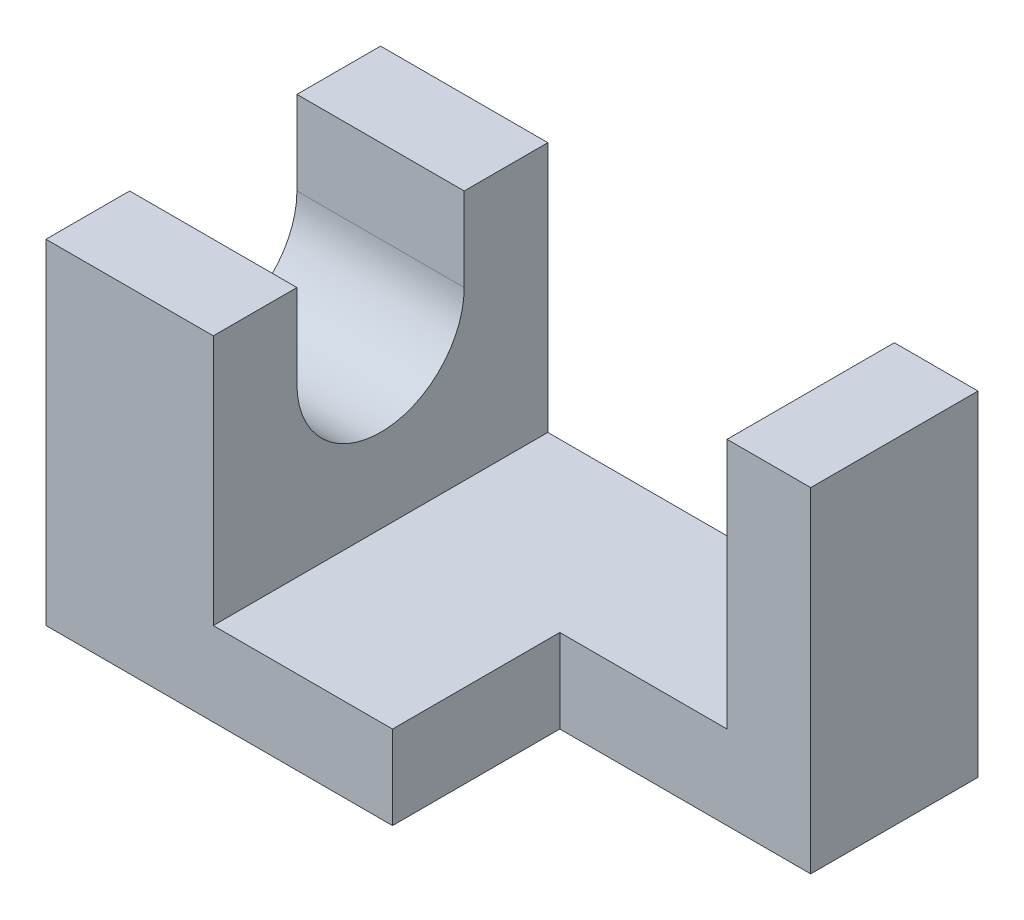
ISO-10303-21;
HEADER;
FILE_DESCRIPTION(('STEP AP214'),'2;1');
FILE_NAME('part.step','',(''),(''),'','','');
FILE_SCHEMA(('AUTOMOTIVE_DESIGN { 1 0 10303 214 1 1 1 1 }'));
ENDSEC;
DATA;
#1=APPLICATION_CONTEXT('core data for automotive mechanical design processes');
#2=APPLICATION_PROTOCOL_DEFINITION('international standard','automotive_design',2000,#1);
#3=PRODUCT_CONTEXT('',#1,'mechanical');
#4=PRODUCT('Part','Part','',(#3));
#5=PRODUCT_RELATED_PRODUCT_CATEGORY('part','',(#4));
#6=PRODUCT_DEFINITION_FORMATION('','',#4);
#7=PRODUCT_DEFINITION_CONTEXT('part definition',#1,'design');
#8=PRODUCT_DEFINITION('design','',#6,#7);
#9=PRODUCT_DEFINITION_SHAPE('','',#8);
#10=(LENGTH_UNIT() NAMED_UNIT(*) SI_UNIT(.MILLI.,.METRE.));
#11=(NAMED_UNIT(*) PLANE_ANGLE_UNIT() SI_UNIT($,.RADIAN.));
#12=(NAMED_UNIT(*) SI_UNIT($,.STERADIAN.) SOLID_ANGLE_UNIT());
#13=UNCERTAINTY_MEASURE_WITH_UNIT(LENGTH_MEASURE(1.E-05),#10,'distance_accuracy_value','');
#14=(GEOMETRIC_REPRESENTATION_CONTEXT(3) GLOBAL_UNCERTAINTY_ASSIGNED_CONTEXT((#13)) GLOBAL_UNIT_ASSIGNED_CONTEXT((#10,
#11,#12)) REPRESENTATION_CONTEXT('',''));
#15=CARTESIAN_POINT('',(0.,0.,0.));
#16=DIRECTION('',(0.,0.,1.));
#17=DIRECTION('',(1.,0.,0.));
#18=AXIS2_PLACEMENT_3D('',#15,#16,#17);
#19=CARTESIAN_POINT('',(0.,28.,14.));
#20=DIRECTION('',(0.,-1.,0.));
#21=DIRECTION('',(0.,0.,-1.));
#22=AXIS2_PLACEMENT_3D('',#19,#20,#21);
#23=PLANE('',#22);
#24=DIRECTION('',(-1.,0.,0.));
#25=VECTOR('',#24,1.);
#26=CARTESIAN_POINT('',(50.001,28.,7.));
#27=LINE('',#26,#25);
#28=CARTESIAN_POINT('',(14.,28.,7.));
#29=VERTEX_POINT('',#28);
#30=CARTESIAN_POINT('',(0.,28.,7.));
#31=VERTEX_POINT('',#30);
#32=EDGE_CURVE('E151',#29,#31,#27,.T.);
#33=ORIENTED_EDGE('',*,*,#32,.T.);
#34=DIRECTION('',(0.,0.,-1.));
#35=VECTOR('',#34,1.);
#36=CARTESIAN_POINT('',(0.,28.,14.));
#37=LINE('',#36,#35);
#38=CARTESIAN_POINT('',(0.,28.,14.));
#39=VERTEX_POINT('',#38);
#40=EDGE_CURVE('E160',#39,#31,#37,.T.);
#41=ORIENTED_EDGE('',*,*,#40,.F.);
#42=DIRECTION('',(-1.,0.,0.));
#43=VECTOR('',#42,1.);
#44=CARTESIAN_POINT('',(0.,28.,14.));
#45=LINE('',#44,#43);
#46=CARTESIAN_POINT('',(14.,28.,14.));
#47=VERTEX_POINT('',#46);
#48=EDGE_CURVE('E192',#47,#39,#45,.T.);
#49=ORIENTED_EDGE('',*,*,#48,.F.);
#50=DIRECTION('',(0.,0.,-1.));
#51=VECTOR('',#50,1.);
#52=CARTESIAN_POINT('',(14.,28.,14.));
#53=LINE('',#52,#51);
#54=EDGE_CURVE('E159',#47,#29,#53,.T.);
#55=ORIENTED_EDGE('',*,*,#54,.T.);
#56=EDGE_LOOP('',(#33,#41,#49,#55));
#57=FACE_BOUND('',#56,.T.);
#58=ADVANCED_FACE('F33',(#57),#23,.F.);
#59=DIRECTION('',(-1.,0.,0.));
#60=VECTOR('',#59,1.);
#61=CARTESIAN_POINT('',(50.001,28.,-7.));
#62=LINE('',#61,#60);
#63=CARTESIAN_POINT('',(14.,28.,-7.));
#64=VERTEX_POINT('',#63);
#65=CARTESIAN_POINT('',(0.,28.,-7.));
#66=VERTEX_POINT('',#65);
#67=EDGE_CURVE('E136',#64,#66,#62,.T.);
#68=ORIENTED_EDGE('',*,*,#67,.F.);
#69=CARTESIAN_POINT('',(14.,28.,-14.));
#70=VERTEX_POINT('',#69);
#71=EDGE_CURVE('E148',#64,#70,#53,.T.);
#72=ORIENTED_EDGE('',*,*,#71,.T.);
#73=DIRECTION('',(-1.,0.,0.));
#74=VECTOR('',#73,1.);
#75=CARTESIAN_POINT('',(0.,28.,-14.));
#76=LINE('',#75,#74);
#77=CARTESIAN_POINT('',(0.,28.,-14.));
#78=VERTEX_POINT('',#77);
#79=EDGE_CURVE('E218',#70,#78,#76,.T.);
#80=ORIENTED_EDGE('',*,*,#79,.T.);
#81=EDGE_CURVE('E150',#66,#78,#37,.T.);
#82=ORIENTED_EDGE('',*,*,#81,.F.);
#83=EDGE_LOOP('',(#68,#72,#80,#82));
#84=FACE_BOUND('',#83,.T.);
#85=ADVANCED_FACE('F146',(#84),#23,.F.);
#86=CARTESIAN_POINT('',(0.,0.,14.));
#87=DIRECTION('',(0.,1.,0.));
#88=DIRECTION('',(0.,0.,1.));
#89=AXIS2_PLACEMENT_3D('',#86,#87,#88);
#90=PLANE('',#89);
#91=DIRECTION('',(-1.,0.,0.));
#92=VECTOR('',#91,1.);
#93=CARTESIAN_POINT('',(50.,0.,0.));
#94=LINE('',#93,#92);
#95=CARTESIAN_POINT('',(50.,0.,0.));
#96=VERTEX_POINT('',#95);
#97=CARTESIAN_POINT('',(29.,0.,0.));
#98=VERTEX_POINT('',#97);
#99=EDGE_CURVE('E235',#96,#98,#94,.T.);
#100=ORIENTED_EDGE('',*,*,#99,.T.);
#101=DIRECTION('',(0.,0.,1.));
#102=VECTOR('',#101,1.);
#103=CARTESIAN_POINT('',(29.,0.,0.));
#104=LINE('',#103,#102);
#105=CARTESIAN_POINT('',(29.,0.,14.));
#106=VERTEX_POINT('',#105);
#107=EDGE_CURVE('E263',#98,#106,#104,.T.);
#108=ORIENTED_EDGE('',*,*,#107,.T.);
#109=DIRECTION('',(1.,0.,0.));
#110=VECTOR('',#109,1.);
#111=CARTESIAN_POINT('',(0.,0.,14.));
#112=LINE('',#111,#110);
#113=CARTESIAN_POINT('',(0.,0.,14.));
#114=VERTEX_POINT('',#113);
#115=EDGE_CURVE('E183',#114,#106,#112,.T.);
#116=ORIENTED_EDGE('',*,*,#115,.F.);
#117=DIRECTION('',(0.,0.,-1.));
#118=VECTOR('',#117,1.);
#119=CARTESIAN_POINT('',(0.,0.,14.));
#120=LINE('',#119,#118);
#121=CARTESIAN_POINT('',(0.,0.,-14.));
#122=VERTEX_POINT('',#121);
#123=EDGE_CURVE('E201',#114,#122,#120,.T.);
#124=ORIENTED_EDGE('',*,*,#123,.T.);
#125=DIRECTION('',(1.,0.,0.));
#126=VECTOR('',#125,1.);
#127=CARTESIAN_POINT('',(0.,0.,-14.));
#128=LINE('',#127,#126);
#129=CARTESIAN_POINT('',(50.,0.,-14.));
#130=VERTEX_POINT('',#129);
#131=EDGE_CURVE('E202',#122,#130,#128,.T.);
#132=ORIENTED_EDGE('',*,*,#131,.T.);
#133=DIRECTION('',(0.,0.,-1.));
#134=VECTOR('',#133,1.);
#135=CARTESIAN_POINT('',(50.,0.,14.));
#136=LINE('',#135,#134);
#137=EDGE_CURVE('E175',#96,#130,#136,.T.);
#138=ORIENTED_EDGE('',*,*,#137,.F.);
#139=EDGE_LOOP('',(#100,#108,#116,#124,#132,#138));
#140=FACE_BOUND('',#139,.T.);
#141=ADVANCED_FACE('F35',(#140),#90,.F.);
#142=CARTESIAN_POINT('',(50.,0.,14.));
#143=DIRECTION('',(-1.,0.,0.));
#144=DIRECTION('',(0.,0.,1.));
#145=AXIS2_PLACEMENT_3D('',#142,#143,#144);
#146=PLANE('',#145);
#147=DIRECTION('',(0.,-1.,0.));
#148=VECTOR('',#147,1.);
#149=CARTESIAN_POINT('',(50.,28.,0.));
#150=LINE('',#149,#148);
#151=CARTESIAN_POINT('',(50.,28.,0.));
#152=VERTEX_POINT('',#151);
#153=EDGE_CURVE('E240',#152,#96,#150,.T.);
#154=ORIENTED_EDGE('',*,*,#153,.T.);
#155=ORIENTED_EDGE('',*,*,#137,.T.);
#156=DIRECTION('',(0.,1.,0.));
#157=VECTOR('',#156,1.);
#158=CARTESIAN_POINT('',(50.,0.,-14.));
#159=LINE('',#158,#157);
#160=CARTESIAN_POINT('',(50.,28.,-14.));
#161=VERTEX_POINT('',#160);
#162=EDGE_CURVE('E205',#130,#161,#159,.T.);
#163=ORIENTED_EDGE('',*,*,#162,.T.);
#164=DIRECTION('',(0.,0.,-1.));
#165=VECTOR('',#164,1.);
#166=CARTESIAN_POINT('',(50.,28.,14.));
#167=LINE('',#166,#165);
#168=EDGE_CURVE('E173',#152,#161,#167,.T.);
#169=ORIENTED_EDGE('',*,*,#168,.F.);
#170=EDGE_LOOP('',(#154,#155,#163,#169));
#171=FACE_BOUND('',#170,.T.);
#172=ADVANCED_FACE('F238',(#171),#146,.F.);
#173=CARTESIAN_POINT('',(50.,28.,14.));
#174=DIRECTION('',(0.,-1.,0.));
#175=DIRECTION('',(0.,0.,-1.));
#176=AXIS2_PLACEMENT_3D('',#173,#174,#175);
#177=PLANE('',#176);
#178=DIRECTION('',(-1.,0.,0.));
#179=VECTOR('',#178,1.);
#180=CARTESIAN_POINT('',(50.,28.,0.));
#181=LINE('',#180,#179);
#182=CARTESIAN_POINT('',(43.,28.,0.));
#183=VERTEX_POINT('',#182);
#184=EDGE_CURVE('E246',#152,#183,#181,.T.);
#185=ORIENTED_EDGE('',*,*,#184,.F.);
#186=ORIENTED_EDGE('',*,*,#168,.T.);
#187=DIRECTION('',(-1.,0.,0.));
#188=VECTOR('',#187,1.);
#189=CARTESIAN_POINT('',(50.,28.,-14.));
#190=LINE('',#189,#188);
#191=CARTESIAN_POINT('',(43.,28.,-14.));
#192=VERTEX_POINT('',#191);
#193=EDGE_CURVE('E209',#161,#192,#190,.T.);
#194=ORIENTED_EDGE('',*,*,#193,.T.);
#195=DIRECTION('',(0.,0.,-1.));
#196=VECTOR('',#195,1.);
#197=CARTESIAN_POINT('',(43.,28.,14.));
#198=LINE('',#197,#196);
#199=EDGE_CURVE('E171',#183,#192,#198,.T.);
#200=ORIENTED_EDGE('',*,*,#199,.F.);
#201=EDGE_LOOP('',(#185,#186,#194,#200));
#202=FACE_BOUND('',#201,.T.);
#203=ADVANCED_FACE('F306',(#202),#177,.F.);
#204=CARTESIAN_POINT('',(43.,28.,14.));
#205=DIRECTION('',(1.,0.,0.));
#206=DIRECTION('',(0.,0.,-1.));
#207=AXIS2_PLACEMENT_3D('',#204,#205,#206);
#208=PLANE('',#207);
#209=DIRECTION('',(0.,-1.,0.));
#210=VECTOR('',#209,1.);
#211=CARTESIAN_POINT('',(43.,28.,0.));
#212=LINE('',#211,#210);
#213=CARTESIAN_POINT('',(43.,7.,0.));
#214=VERTEX_POINT('',#213);
#215=EDGE_CURVE('E206',#183,#214,#212,.T.);
#216=ORIENTED_EDGE('',*,*,#215,.F.);
#217=ORIENTED_EDGE('',*,*,#199,.T.);
#218=DIRECTION('',(0.,-1.,0.));
#219=VECTOR('',#218,1.);
#220=CARTESIAN_POINT('',(43.,28.,-14.));
#221=LINE('',#220,#219);
#222=CARTESIAN_POINT('',(43.,7.,-14.));
#223=VERTEX_POINT('',#222);
#224=EDGE_CURVE('E212',#192,#223,#221,.T.);
#225=ORIENTED_EDGE('',*,*,#224,.T.);
#226=DIRECTION('',(0.,0.,-1.));
#227=VECTOR('',#226,1.);
#228=CARTESIAN_POINT('',(43.,7.,14.));
#229=LINE('',#228,#227);
#230=EDGE_CURVE('E169',#214,#223,#229,.T.);
#231=ORIENTED_EDGE('',*,*,#230,.F.);
#232=EDGE_LOOP('',(#216,#217,#225,#231));
#233=FACE_BOUND('',#232,.T.);
#234=ADVANCED_FACE('F254',(#233),#208,.F.);
#235=CARTESIAN_POINT('',(14.,7.,14.));
#236=DIRECTION('',(0.,-1.,0.));
#237=DIRECTION('',(0.,0.,-1.));
#238=AXIS2_PLACEMENT_3D('',#235,#236,#237);
#239=PLANE('',#238);
#240=DIRECTION('',(-1.,0.,0.));
#241=VECTOR('',#240,1.);
#242=CARTESIAN_POINT('',(14.,7.,0.));
#243=LINE('',#242,#241);
#244=CARTESIAN_POINT('',(29.,7.,0.));
#245=VERTEX_POINT('',#244);
#246=EDGE_CURVE('E11',#214,#245,#243,.T.);
#247=ORIENTED_EDGE('',*,*,#246,.F.);
#248=ORIENTED_EDGE('',*,*,#230,.T.);
#249=DIRECTION('',(-1.,0.,0.));
#250=VECTOR('',#249,1.);
#251=CARTESIAN_POINT('',(14.,7.,-14.));
#252=LINE('',#251,#250);
#253=CARTESIAN_POINT('',(14.,7.,-14.));
#254=VERTEX_POINT('',#253);
#255=EDGE_CURVE('E215',#223,#254,#252,.T.);
#256=ORIENTED_EDGE('',*,*,#255,.T.);
#257=DIRECTION('',(0.,0.,-1.));
#258=VECTOR('',#257,1.);
#259=CARTESIAN_POINT('',(14.,7.,14.));
#260=LINE('',#259,#258);
#261=CARTESIAN_POINT('',(14.,7.,14.));
#262=VERTEX_POINT('',#261);
#263=EDGE_CURVE('E163',#262,#254,#260,.T.);
#264=ORIENTED_EDGE('',*,*,#263,.F.);
#265=DIRECTION('',(-1.,0.,0.));
#266=VECTOR('',#265,1.);
#267=CARTESIAN_POINT('',(14.,7.,14.));
#268=LINE('',#267,#266);
#269=CARTESIAN_POINT('',(29.,7.,14.));
#270=VERTEX_POINT('',#269);
#271=EDGE_CURVE('E180',#270,#262,#268,.T.);
#272=ORIENTED_EDGE('',*,*,#271,.F.);
#273=DIRECTION('',(0.,0.,1.));
#274=VECTOR('',#273,1.);
#275=CARTESIAN_POINT('',(29.,7.,14.));
#276=LINE('',#275,#274);
#277=EDGE_CURVE('E56',#245,#270,#276,.T.);
#278=ORIENTED_EDGE('',*,*,#277,.F.);
#279=EDGE_LOOP('',(#247,#248,#256,#264,#272,#278));
#280=FACE_BOUND('',#279,.T.);
#281=ADVANCED_FACE('F188',(#280),#239,.F.);
#282=CARTESIAN_POINT('',(0.,0.,14.));
#283=DIRECTION('',(0.,0.,1.));
#284=DIRECTION('',(1.,0.,0.));
#285=AXIS2_PLACEMENT_3D('',#282,#283,#284);
#286=PLANE('',#285);
#287=ORIENTED_EDGE('',*,*,#115,.T.);
#288=DIRECTION('',(0.,1.,0.));
#289=VECTOR('',#288,1.);
#290=CARTESIAN_POINT('',(29.,0.,14.));
#291=LINE('',#290,#289);
#292=EDGE_CURVE('E41',#106,#270,#291,.T.);
#293=ORIENTED_EDGE('',*,*,#292,.T.);
#294=ORIENTED_EDGE('',*,*,#271,.T.);
#295=DIRECTION('',(0.,1.,0.));
#296=VECTOR('',#295,1.);
#297=CARTESIAN_POINT('',(14.,28.,14.));
#298=LINE('',#297,#296);
#299=EDGE_CURVE('E190',#262,#47,#298,.T.);
#300=ORIENTED_EDGE('',*,*,#299,.T.);
#301=ORIENTED_EDGE('',*,*,#48,.T.);
#302=DIRECTION('',(0.,-1.,0.));
#303=VECTOR('',#302,1.);
#304=CARTESIAN_POINT('',(0.,0.,14.));
#305=LINE('',#304,#303);
#306=EDGE_CURVE('E199',#39,#114,#305,.T.);
#307=ORIENTED_EDGE('',*,*,#306,.T.);
#308=EDGE_LOOP('',(#287,#293,#294,#300,#301,#307));
#309=FACE_BOUND('',#308,.T.);
#310=ADVANCED_FACE('F179',(#309),#286,.T.);
#311=CARTESIAN_POINT('',(14.,28.,14.));
#312=DIRECTION('',(-1.,0.,0.));
#313=DIRECTION('',(0.,0.,1.));
#314=AXIS2_PLACEMENT_3D('',#311,#312,#313);
#315=PLANE('',#314);
#316=DIRECTION('',(0.,1.,0.));
#317=VECTOR('',#316,1.);
#318=CARTESIAN_POINT('',(14.,21.,7.));
#319=LINE('',#318,#317);
#320=CARTESIAN_POINT('',(14.,21.,7.));
#321=VERTEX_POINT('',#320);
#322=EDGE_CURVE('E265',#321,#29,#319,.T.);
#323=ORIENTED_EDGE('',*,*,#322,.T.);
#324=ORIENTED_EDGE('',*,*,#54,.F.);
#325=ORIENTED_EDGE('',*,*,#299,.F.);
#326=ORIENTED_EDGE('',*,*,#263,.T.);
#327=DIRECTION('',(0.,1.,0.));
#328=VECTOR('',#327,1.);
#329=CARTESIAN_POINT('',(14.,28.,-14.));
#330=LINE('',#329,#328);
#331=EDGE_CURVE('E157',#254,#70,#330,.T.);
#332=ORIENTED_EDGE('',*,*,#331,.T.);
#333=ORIENTED_EDGE('',*,*,#71,.F.);
#334=DIRECTION('',(0.,-1.,0.));
#335=VECTOR('',#334,1.);
#336=CARTESIAN_POINT('',(14.,21.,-7.));
#337=LINE('',#336,#335);
#338=CARTESIAN_POINT('',(14.,21.,-7.));
#339=VERTEX_POINT('',#338);
#340=EDGE_CURVE('E133',#64,#339,#337,.T.);
#341=ORIENTED_EDGE('',*,*,#340,.T.);
#342=CARTESIAN_POINT('',(14.,21.,0.));
#343=DIRECTION('',(-1.,0.,0.));
#344=DIRECTION('',(0.,0.,1.));
#345=AXIS2_PLACEMENT_3D('',#342,#343,#344);
#346=CIRCLE('',#345,7.);
#347=EDGE_CURVE('E142',#339,#321,#346,.T.);
#348=ORIENTED_EDGE('',*,*,#347,.T.);
#349=EDGE_LOOP('',(#323,#324,#325,#326,#332,#333,#341,#348));
#350=FACE_BOUND('',#349,.T.);
#351=ADVANCED_FACE('F154',(#350),#315,.F.);
#352=CARTESIAN_POINT('',(0.,0.,14.));
#353=DIRECTION('',(1.,0.,0.));
#354=DIRECTION('',(0.,0.,-1.));
#355=AXIS2_PLACEMENT_3D('',#352,#353,#354);
#356=PLANE('',#355);
#357=DIRECTION('',(0.,-1.,0.));
#358=VECTOR('',#357,1.);
#359=CARTESIAN_POINT('',(0.,21.,7.));
#360=LINE('',#359,#358);
#361=CARTESIAN_POINT('',(0.,21.,7.));
#362=VERTEX_POINT('',#361);
#363=EDGE_CURVE('E273',#31,#362,#360,.T.);
#364=ORIENTED_EDGE('',*,*,#363,.T.);
#365=CARTESIAN_POINT('',(0.,21.,0.));
#366=DIRECTION('',(1.,0.,0.));
#367=DIRECTION('',(0.,0.,-1.));
#368=AXIS2_PLACEMENT_3D('',#365,#366,#367);
#369=CIRCLE('',#368,7.);
#370=CARTESIAN_POINT('',(0.,21.,-7.));
#371=VERTEX_POINT('',#370);
#372=EDGE_CURVE('E141',#362,#371,#369,.T.);
#373=ORIENTED_EDGE('',*,*,#372,.T.);
#374=DIRECTION('',(0.,1.,0.));
#375=VECTOR('',#374,1.);
#376=CARTESIAN_POINT('',(0.,21.,-7.));
#377=LINE('',#376,#375);
#378=EDGE_CURVE('E48',#371,#66,#377,.T.);
#379=ORIENTED_EDGE('',*,*,#378,.T.);
#380=ORIENTED_EDGE('',*,*,#81,.T.);
#381=DIRECTION('',(0.,-1.,0.));
#382=VECTOR('',#381,1.);
#383=CARTESIAN_POINT('',(0.,0.,-14.));
#384=LINE('',#383,#382);
#385=EDGE_CURVE('E194',#78,#122,#384,.T.);
#386=ORIENTED_EDGE('',*,*,#385,.T.);
#387=ORIENTED_EDGE('',*,*,#123,.F.);
#388=ORIENTED_EDGE('',*,*,#306,.F.);
#389=ORIENTED_EDGE('',*,*,#40,.T.);
#390=EDGE_LOOP('',(#364,#373,#379,#380,#386,#387,#388,#389));
#391=FACE_BOUND('',#390,.T.);
#392=ADVANCED_FACE('F226',(#391),#356,.F.);
#393=CARTESIAN_POINT('',(0.,0.,-14.));
#394=DIRECTION('',(0.,0.,1.));
#395=DIRECTION('',(1.,0.,0.));
#396=AXIS2_PLACEMENT_3D('',#393,#394,#395);
#397=PLANE('',#396);
#398=ORIENTED_EDGE('',*,*,#131,.F.);
#399=ORIENTED_EDGE('',*,*,#385,.F.);
#400=ORIENTED_EDGE('',*,*,#79,.F.);
#401=ORIENTED_EDGE('',*,*,#331,.F.);
#402=ORIENTED_EDGE('',*,*,#255,.F.);
#403=ORIENTED_EDGE('',*,*,#224,.F.);
#404=ORIENTED_EDGE('',*,*,#193,.F.);
#405=ORIENTED_EDGE('',*,*,#162,.F.);
#406=EDGE_LOOP('',(#398,#399,#400,#401,#402,#403,#404,#405));
#407=FACE_BOUND('',#406,.T.);
#408=ADVANCED_FACE('F230',(#407),#397,.F.);
#409=CARTESIAN_POINT('',(50.,28.,0.));
#410=DIRECTION('',(0.,0.,1.));
#411=DIRECTION('',(1.,0.,0.));
#412=AXIS2_PLACEMENT_3D('',#409,#410,#411);
#413=PLANE('',#412);
#414=ORIENTED_EDGE('',*,*,#215,.T.);
#415=ORIENTED_EDGE('',*,*,#246,.T.);
#416=DIRECTION('',(0.,-1.,0.));
#417=VECTOR('',#416,1.);
#418=CARTESIAN_POINT('',(29.,28.,0.));
#419=LINE('',#418,#417);
#420=EDGE_CURVE('E243',#245,#98,#419,.T.);
#421=ORIENTED_EDGE('',*,*,#420,.T.);
#422=ORIENTED_EDGE('',*,*,#99,.F.);
#423=ORIENTED_EDGE('',*,*,#153,.F.);
#424=ORIENTED_EDGE('',*,*,#184,.T.);
#425=EDGE_LOOP('',(#414,#415,#421,#422,#423,#424));
#426=FACE_BOUND('',#425,.T.);
#427=ADVANCED_FACE('F250',(#426),#413,.T.);
#428=CARTESIAN_POINT('',(29.,28.,0.));
#429=DIRECTION('',(1.,0.,0.));
#430=DIRECTION('',(0.,0.,-1.));
#431=AXIS2_PLACEMENT_3D('',#428,#429,#430);
#432=PLANE('',#431);
#433=ORIENTED_EDGE('',*,*,#277,.T.);
#434=ORIENTED_EDGE('',*,*,#292,.F.);
#435=ORIENTED_EDGE('',*,*,#107,.F.);
#436=ORIENTED_EDGE('',*,*,#420,.F.);
#437=EDGE_LOOP('',(#433,#434,#435,#436));
#438=FACE_BOUND('',#437,.T.);
#439=ADVANCED_FACE('F284',(#438),#432,.T.);
#440=CARTESIAN_POINT('',(50.001,21.,7.));
#441=DIRECTION('',(0.,0.,-1.));
#442=DIRECTION('',(-1.,0.,0.));
#443=AXIS2_PLACEMENT_3D('',#440,#441,#442);
#444=PLANE('',#443);
#445=DIRECTION('',(-1.,0.,0.));
#446=VECTOR('',#445,1.);
#447=CARTESIAN_POINT('',(50.001,21.,7.));
#448=LINE('',#447,#446);
#449=EDGE_CURVE('E271',#321,#362,#448,.T.);
#450=ORIENTED_EDGE('',*,*,#449,.T.);
#451=ORIENTED_EDGE('',*,*,#363,.F.);
#452=ORIENTED_EDGE('',*,*,#32,.F.);
#453=ORIENTED_EDGE('',*,*,#322,.F.);
#454=EDGE_LOOP('',(#450,#451,#452,#453));
#455=FACE_BOUND('',#454,.T.);
#456=ADVANCED_FACE('F282',(#455),#444,.T.);
#457=CARTESIAN_POINT('',(50.001,21.,-7.));
#458=DIRECTION('',(0.,0.,1.));
#459=DIRECTION('',(1.,0.,0.));
#460=AXIS2_PLACEMENT_3D('',#457,#458,#459);
#461=PLANE('',#460);
#462=ORIENTED_EDGE('',*,*,#67,.T.);
#463=ORIENTED_EDGE('',*,*,#378,.F.);
#464=DIRECTION('',(-1.,0.,0.));
#465=VECTOR('',#464,1.);
#466=CARTESIAN_POINT('',(50.001,21.,-7.));
#467=LINE('',#466,#465);
#468=EDGE_CURVE('E137',#339,#371,#467,.T.);
#469=ORIENTED_EDGE('',*,*,#468,.F.);
#470=ORIENTED_EDGE('',*,*,#340,.F.);
#471=EDGE_LOOP('',(#462,#463,#469,#470));
#472=FACE_BOUND('',#471,.T.);
#473=ADVANCED_FACE('F135',(#472),#461,.T.);
#474=CARTESIAN_POINT('',(50.001,21.,0.));
#475=DIRECTION('',(-1.,0.,0.));
#476=DIRECTION('',(0.,0.,1.));
#477=AXIS2_PLACEMENT_3D('',#474,#475,#476);
#478=CYLINDRICAL_SURFACE('',#477,7.);
#479=ORIENTED_EDGE('',*,*,#468,.T.);
#480=ORIENTED_EDGE('',*,*,#372,.F.);
#481=ORIENTED_EDGE('',*,*,#449,.F.);
#482=ORIENTED_EDGE('',*,*,#347,.F.);
#483=EDGE_LOOP('',(#479,#480,#481,#482));
#484=FACE_BOUND('',#483,.T.);
#485=ADVANCED_FACE('F279',(#484),#478,.F.);
#486=CLOSED_SHELL('',(#58,#85,#141,#172,#203,#234,#281,#310,#351,#392,#408,#427,#439,#456,#473,#485));
#487=MANIFOLD_SOLID_BREP('B2',#486);
#488=ADVANCED_BREP_SHAPE_REPRESENTATION('',(#18,#487),#14);
#489=SHAPE_DEFINITION_REPRESENTATION(#9,#488);
ENDSEC;
END-ISO-10303-21;
